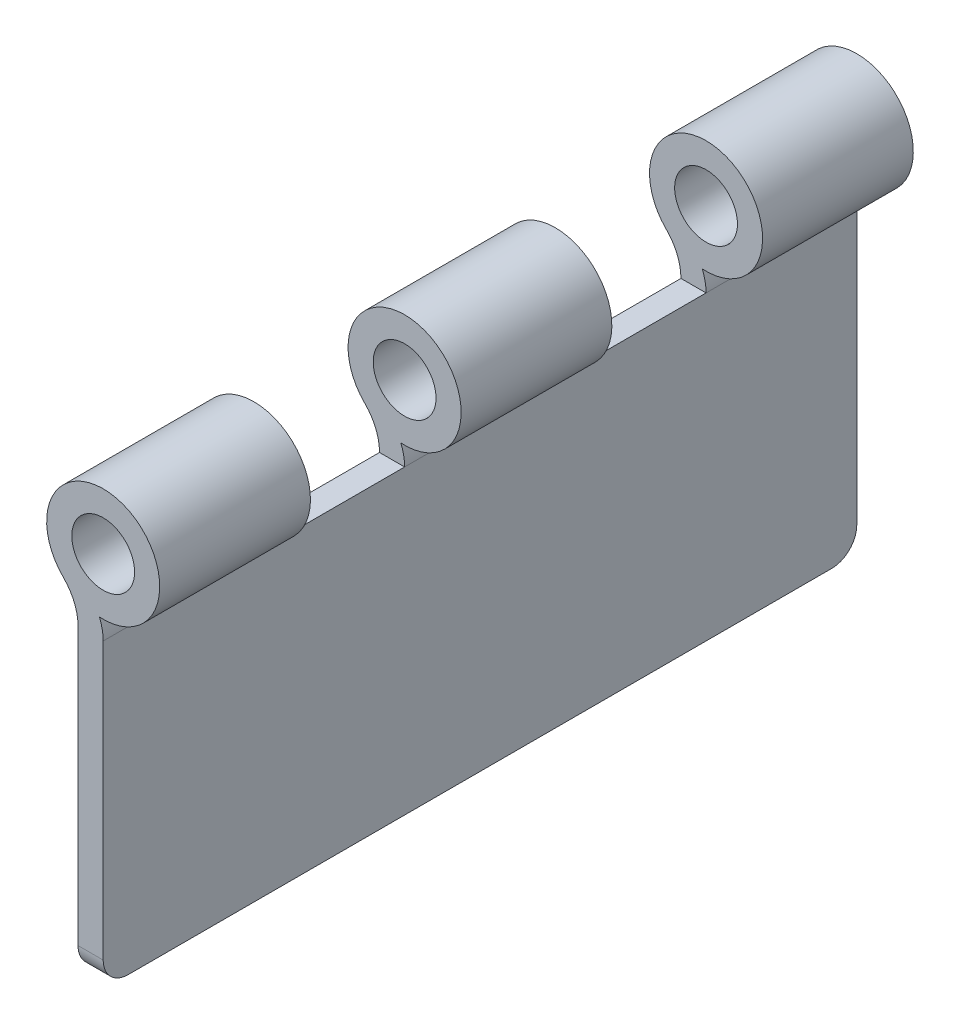
ISO-10303-21;
HEADER;
FILE_DESCRIPTION(('STEP AP214'),'2;1');
FILE_NAME('part.step','',(''),(''),'','','');
FILE_SCHEMA(('AUTOMOTIVE_DESIGN { 1 0 10303 214 1 1 1 1 }'));
ENDSEC;
DATA;
#1=APPLICATION_CONTEXT('core data for automotive mechanical design processes');
#2=APPLICATION_PROTOCOL_DEFINITION('international standard','automotive_design',2000,#1);
#3=PRODUCT_CONTEXT('',#1,'mechanical');
#4=PRODUCT('Part','Part','',(#3));
#5=PRODUCT_RELATED_PRODUCT_CATEGORY('part','',(#4));
#6=PRODUCT_DEFINITION_FORMATION('','',#4);
#7=PRODUCT_DEFINITION_CONTEXT('part definition',#1,'design');
#8=PRODUCT_DEFINITION('design','',#6,#7);
#9=PRODUCT_DEFINITION_SHAPE('','',#8);
#10=(LENGTH_UNIT() NAMED_UNIT(*) SI_UNIT(.MILLI.,.METRE.));
#11=(NAMED_UNIT(*) PLANE_ANGLE_UNIT() SI_UNIT($,.RADIAN.));
#12=(NAMED_UNIT(*) SI_UNIT($,.STERADIAN.) SOLID_ANGLE_UNIT());
#13=UNCERTAINTY_MEASURE_WITH_UNIT(LENGTH_MEASURE(1.E-05),#10,'distance_accuracy_value','');
#14=(GEOMETRIC_REPRESENTATION_CONTEXT(3) GLOBAL_UNCERTAINTY_ASSIGNED_CONTEXT((#13)) GLOBAL_UNIT_ASSIGNED_CONTEXT((#10,
#11,#12)) REPRESENTATION_CONTEXT('',''));
#15=CARTESIAN_POINT('',(0.,0.,0.));
#16=DIRECTION('',(0.,0.,1.));
#17=DIRECTION('',(1.,0.,0.));
#18=AXIS2_PLACEMENT_3D('',#15,#16,#17);
#19=CARTESIAN_POINT('',(-5.0165,30.48,38.1));
#20=DIRECTION('',(0.,0.,-1.));
#21=DIRECTION('',(-1.,0.,0.));
#22=AXIS2_PLACEMENT_3D('',#19,#20,#21);
#23=CYLINDRICAL_SURFACE('',#22,5.0165);
#24=CARTESIAN_POINT('',(-5.0165,30.48,-7.62));
#25=DIRECTION('',(0.,0.,1.));
#26=DIRECTION('',(1.,0.,0.));
#27=AXIS2_PLACEMENT_3D('',#24,#25,#26);
#28=CIRCLE('',#27,5.0165);
#29=CARTESIAN_POINT('',(0.,30.48,-7.62));
#30=VERTEX_POINT('',#29);
#31=CARTESIAN_POINT('',(-0.381023909004146,32.3977157400944,-7.62));
#32=VERTEX_POINT('',#31);
#33=EDGE_CURVE('E152',#30,#32,#28,.T.);
#34=ORIENTED_EDGE('',*,*,#33,.T.);
#35=DIRECTION('',(0.,0.,-1.));
#36=VECTOR('',#35,1.);
#37=CARTESIAN_POINT('',(-0.381023909004146,32.3977157400944,38.1));
#38=LINE('',#37,#36);
#39=CARTESIAN_POINT('',(-0.381023909004146,32.3977157400944,7.62));
#40=VERTEX_POINT('',#39);
#41=EDGE_CURVE('E247',#40,#32,#38,.T.);
#42=ORIENTED_EDGE('',*,*,#41,.F.);
#43=CARTESIAN_POINT('',(-5.0165,30.48,7.62));
#44=DIRECTION('',(0.,0.,1.));
#45=DIRECTION('',(1.,0.,0.));
#46=AXIS2_PLACEMENT_3D('',#43,#44,#45);
#47=CIRCLE('',#46,5.0165);
#48=CARTESIAN_POINT('',(0.,30.48,7.62));
#49=VERTEX_POINT('',#48);
#50=EDGE_CURVE('E184',#49,#40,#47,.T.);
#51=ORIENTED_EDGE('',*,*,#50,.F.);
#52=DIRECTION('',(0.,0.,-1.));
#53=VECTOR('',#52,1.);
#54=CARTESIAN_POINT('',(0.,30.48,38.1));
#55=LINE('',#54,#53);
#56=EDGE_CURVE('E179',#49,#30,#55,.T.);
#57=ORIENTED_EDGE('',*,*,#56,.T.);
#58=EDGE_LOOP('',(#34,#42,#51,#57));
#59=FACE_BOUND('',#58,.T.);
#60=ADVANCED_FACE('F38',(#59),#23,.T.);
#61=CARTESIAN_POINT('',(0.,38.1,38.1));
#62=DIRECTION('',(0.,0.,-1.));
#63=DIRECTION('',(-1.,0.,0.));
#64=AXIS2_PLACEMENT_3D('',#61,#62,#63);
#65=CYLINDRICAL_SURFACE('',#64,5.715);
#66=CARTESIAN_POINT('',(0.,38.1,-7.62));
#67=DIRECTION('',(0.,0.,1.));
#68=DIRECTION('',(1.,0.,0.));
#69=AXIS2_PLACEMENT_3D('',#66,#67,#68);
#70=CIRCLE('',#69,5.715);
#71=CARTESIAN_POINT('',(-4.02417159763314,34.0420118343195,-7.62));
#72=VERTEX_POINT('',#71);
#73=EDGE_CURVE('E158',#32,#72,#70,.T.);
#74=ORIENTED_EDGE('',*,*,#73,.T.);
#75=DIRECTION('',(0.,0.,-1.));
#76=VECTOR('',#75,1.);
#77=CARTESIAN_POINT('',(-4.02417159763314,34.0420118343195,38.1));
#78=LINE('',#77,#76);
#79=CARTESIAN_POINT('',(-4.02417159763314,34.0420118343195,7.62));
#80=VERTEX_POINT('',#79);
#81=EDGE_CURVE('E242',#80,#72,#78,.T.);
#82=ORIENTED_EDGE('',*,*,#81,.F.);
#83=CARTESIAN_POINT('',(0.,38.1,7.62));
#84=DIRECTION('',(0.,0.,1.));
#85=DIRECTION('',(1.,0.,0.));
#86=AXIS2_PLACEMENT_3D('',#83,#84,#85);
#87=CIRCLE('',#86,5.715);
#88=EDGE_CURVE('E311',#40,#80,#87,.T.);
#89=ORIENTED_EDGE('',*,*,#88,.F.);
#90=ORIENTED_EDGE('',*,*,#41,.T.);
#91=EDGE_LOOP('',(#74,#82,#89,#90));
#92=FACE_BOUND('',#91,.T.);
#93=ADVANCED_FACE('F355',(#92),#65,.T.);
#94=CARTESIAN_POINT('',(-7.55650000000001,30.48,38.1));
#95=DIRECTION('',(0.,0.,-1.));
#96=DIRECTION('',(-1.,0.,0.));
#97=AXIS2_PLACEMENT_3D('',#94,#95,#96);
#98=CYLINDRICAL_SURFACE('',#97,5.01650000000001);
#99=ORIENTED_EDGE('',*,*,#81,.T.);
#100=CARTESIAN_POINT('',(-7.55650000000001,30.48,-7.62));
#101=DIRECTION('',(0.,0.,1.));
#102=DIRECTION('',(1.,0.,0.));
#103=AXIS2_PLACEMENT_3D('',#100,#101,#102);
#104=CIRCLE('',#103,5.01650000000001);
#105=CARTESIAN_POINT('',(-2.54,30.48,-7.62));
#106=VERTEX_POINT('',#105);
#107=EDGE_CURVE('E172',#106,#72,#104,.T.);
#108=ORIENTED_EDGE('',*,*,#107,.F.);
#109=DIRECTION('',(0.,0.,-1.));
#110=VECTOR('',#109,1.);
#111=CARTESIAN_POINT('',(-2.54,30.48,38.1));
#112=LINE('',#111,#110);
#113=CARTESIAN_POINT('',(-2.54,30.48,7.62000000000001));
#114=VERTEX_POINT('',#113);
#115=EDGE_CURVE('E231',#114,#106,#112,.T.);
#116=ORIENTED_EDGE('',*,*,#115,.F.);
#117=CARTESIAN_POINT('',(-7.55650000000001,30.48,7.62));
#118=DIRECTION('',(0.,0.,1.));
#119=DIRECTION('',(1.,0.,0.));
#120=AXIS2_PLACEMENT_3D('',#117,#118,#119);
#121=CIRCLE('',#120,5.01650000000001);
#122=EDGE_CURVE('E313',#114,#80,#121,.T.);
#123=ORIENTED_EDGE('',*,*,#122,.T.);
#124=EDGE_LOOP('',(#99,#108,#116,#123));
#125=FACE_BOUND('',#124,.T.);
#126=ADVANCED_FACE('F361',(#125),#98,.F.);
#127=CARTESIAN_POINT('',(0.,38.1,38.1));
#128=DIRECTION('',(0.,0.,-1.));
#129=DIRECTION('',(-1.,0.,0.));
#130=AXIS2_PLACEMENT_3D('',#127,#128,#129);
#131=CYLINDRICAL_SURFACE('',#130,3.175);
#132=CARTESIAN_POINT('',(0.,38.1,7.62));
#133=DIRECTION('',(0.,0.,1.));
#134=DIRECTION('',(1.,0.,0.));
#135=AXIS2_PLACEMENT_3D('',#132,#133,#134);
#136=CIRCLE('',#135,3.175);
#137=CARTESIAN_POINT('',(3.175,38.1,7.62));
#138=VERTEX_POINT('',#137);
#139=EDGE_CURVE('E306',#138,#138,#136,.T.);
#140=ORIENTED_EDGE('',*,*,#139,.T.);
#141=EDGE_LOOP('',(#140));
#142=FACE_BOUND('',#141,.T.);
#143=CARTESIAN_POINT('',(0.,38.1,-7.62));
#144=DIRECTION('',(0.,0.,1.));
#145=DIRECTION('',(1.,0.,0.));
#146=AXIS2_PLACEMENT_3D('',#143,#144,#145);
#147=CIRCLE('',#146,3.175);
#148=CARTESIAN_POINT('',(3.175,38.1,-7.62));
#149=VERTEX_POINT('',#148);
#150=EDGE_CURVE('E163',#149,#149,#147,.T.);
#151=ORIENTED_EDGE('',*,*,#150,.F.);
#152=EDGE_LOOP('',(#151));
#153=FACE_BOUND('',#152,.T.);
#154=ADVANCED_FACE('F368',(#142,#153),#131,.F.);
#155=CARTESIAN_POINT('',(-0.381023909004146,32.3977157400944,-22.86));
#156=VERTEX_POINT('',#155);
#157=CARTESIAN_POINT('',(-0.381023909004146,32.3977157400944,-38.1));
#158=VERTEX_POINT('',#157);
#159=EDGE_CURVE('E241',#156,#158,#38,.T.);
#160=ORIENTED_EDGE('',*,*,#159,.F.);
#161=CARTESIAN_POINT('',(-5.0165,30.48,-22.86));
#162=DIRECTION('',(0.,0.,1.));
#163=DIRECTION('',(1.,0.,0.));
#164=AXIS2_PLACEMENT_3D('',#161,#162,#163);
#165=CIRCLE('',#164,5.0165);
#166=CARTESIAN_POINT('',(0.,30.48,-22.86));
#167=VERTEX_POINT('',#166);
#168=EDGE_CURVE('E291',#167,#156,#165,.T.);
#169=ORIENTED_EDGE('',*,*,#168,.F.);
#170=CARTESIAN_POINT('',(0.,30.48,-38.1));
#171=VERTEX_POINT('',#170);
#172=EDGE_CURVE('E181',#167,#171,#55,.T.);
#173=ORIENTED_EDGE('',*,*,#172,.T.);
#174=CARTESIAN_POINT('',(-5.0165,30.48,-38.1));
#175=DIRECTION('',(0.,0.,1.));
#176=DIRECTION('',(1.,0.,0.));
#177=AXIS2_PLACEMENT_3D('',#174,#175,#176);
#178=CIRCLE('',#177,5.0165);
#179=EDGE_CURVE('E217',#171,#158,#178,.T.);
#180=ORIENTED_EDGE('',*,*,#179,.T.);
#181=EDGE_LOOP('',(#160,#169,#173,#180));
#182=FACE_BOUND('',#181,.T.);
#183=ADVANCED_FACE('F289',(#182),#23,.T.);
#184=CARTESIAN_POINT('',(-4.02417159763314,34.0420118343195,-22.86));
#185=VERTEX_POINT('',#184);
#186=CARTESIAN_POINT('',(-4.02417159763314,34.0420118343195,-38.1));
#187=VERTEX_POINT('',#186);
#188=EDGE_CURVE('E238',#185,#187,#78,.T.);
#189=ORIENTED_EDGE('',*,*,#188,.F.);
#190=CARTESIAN_POINT('',(0.,38.1,-22.86));
#191=DIRECTION('',(0.,0.,1.));
#192=DIRECTION('',(1.,0.,0.));
#193=AXIS2_PLACEMENT_3D('',#190,#191,#192);
#194=CIRCLE('',#193,5.715);
#195=EDGE_CURVE('E302',#156,#185,#194,.T.);
#196=ORIENTED_EDGE('',*,*,#195,.F.);
#197=ORIENTED_EDGE('',*,*,#159,.T.);
#198=CARTESIAN_POINT('',(0.,38.1,-38.1));
#199=DIRECTION('',(0.,0.,1.));
#200=DIRECTION('',(1.,0.,0.));
#201=AXIS2_PLACEMENT_3D('',#198,#199,#200);
#202=CIRCLE('',#201,5.715);
#203=EDGE_CURVE('E262',#158,#187,#202,.T.);
#204=ORIENTED_EDGE('',*,*,#203,.T.);
#205=EDGE_LOOP('',(#189,#196,#197,#204));
#206=FACE_BOUND('',#205,.T.);
#207=ADVANCED_FACE('F263',(#206),#65,.T.);
#208=CARTESIAN_POINT('',(-7.55650000000001,30.48,-22.86));
#209=DIRECTION('',(0.,0.,1.));
#210=DIRECTION('',(1.,0.,0.));
#211=AXIS2_PLACEMENT_3D('',#208,#209,#210);
#212=CIRCLE('',#211,5.01650000000001);
#213=CARTESIAN_POINT('',(-2.54,30.48,-22.86));
#214=VERTEX_POINT('',#213);
#215=EDGE_CURVE('E259',#214,#185,#212,.T.);
#216=ORIENTED_EDGE('',*,*,#215,.T.);
#217=ORIENTED_EDGE('',*,*,#188,.T.);
#218=CARTESIAN_POINT('',(-7.55650000000001,30.48,-38.1));
#219=DIRECTION('',(0.,0.,1.));
#220=DIRECTION('',(1.,0.,0.));
#221=AXIS2_PLACEMENT_3D('',#218,#219,#220);
#222=CIRCLE('',#221,5.01650000000001);
#223=CARTESIAN_POINT('',(-2.54,30.48,-38.1));
#224=VERTEX_POINT('',#223);
#225=EDGE_CURVE('E257',#224,#187,#222,.T.);
#226=ORIENTED_EDGE('',*,*,#225,.F.);
#227=EDGE_CURVE('E229',#214,#224,#112,.T.);
#228=ORIENTED_EDGE('',*,*,#227,.F.);
#229=EDGE_LOOP('',(#216,#217,#226,#228));
#230=FACE_BOUND('',#229,.T.);
#231=ADVANCED_FACE('F254',(#230),#98,.F.);
#232=CARTESIAN_POINT('',(0.,38.1,-22.86));
#233=DIRECTION('',(0.,0.,1.));
#234=DIRECTION('',(1.,0.,0.));
#235=AXIS2_PLACEMENT_3D('',#232,#233,#234);
#236=CIRCLE('',#235,3.175);
#237=CARTESIAN_POINT('',(3.175,38.1,-22.86));
#238=VERTEX_POINT('',#237);
#239=EDGE_CURVE('E294',#238,#238,#236,.T.);
#240=ORIENTED_EDGE('',*,*,#239,.T.);
#241=EDGE_LOOP('',(#240));
#242=FACE_BOUND('',#241,.T.);
#243=CARTESIAN_POINT('',(0.,38.1,-38.1));
#244=DIRECTION('',(0.,0.,1.));
#245=DIRECTION('',(1.,0.,0.));
#246=AXIS2_PLACEMENT_3D('',#243,#244,#245);
#247=CIRCLE('',#246,3.175);
#248=CARTESIAN_POINT('',(3.175,38.1,-38.1));
#249=VERTEX_POINT('',#248);
#250=EDGE_CURVE('E267',#249,#249,#247,.T.);
#251=ORIENTED_EDGE('',*,*,#250,.F.);
#252=EDGE_LOOP('',(#251));
#253=FACE_BOUND('',#252,.T.);
#254=ADVANCED_FACE('F372',(#242,#253),#131,.F.);
#255=CARTESIAN_POINT('',(0.,0.,38.1));
#256=DIRECTION('',(-1.,0.,0.));
#257=DIRECTION('',(0.,0.,1.));
#258=AXIS2_PLACEMENT_3D('',#255,#256,#257);
#259=PLANE('',#258);
#260=DIRECTION('',(0.,0.,-1.));
#261=VECTOR('',#260,1.);
#262=CARTESIAN_POINT('',(0.,0.,38.1));
#263=LINE('',#262,#261);
#264=CARTESIAN_POINT('',(0.,0.,35.56));
#265=VERTEX_POINT('',#264);
#266=CARTESIAN_POINT('',(0.,0.,-35.56));
#267=VERTEX_POINT('',#266);
#268=EDGE_CURVE('E207',#265,#267,#263,.T.);
#269=ORIENTED_EDGE('',*,*,#268,.T.);
#270=CARTESIAN_POINT('',(0.,2.54,-35.56));
#271=DIRECTION('',(-1.,0.,0.));
#272=DIRECTION('',(0.,0.,1.));
#273=AXIS2_PLACEMENT_3D('',#270,#271,#272);
#274=CIRCLE('',#273,2.54);
#275=CARTESIAN_POINT('',(0.,2.54,-38.1));
#276=VERTEX_POINT('',#275);
#277=EDGE_CURVE('E46',#267,#276,#274,.F.);
#278=ORIENTED_EDGE('',*,*,#277,.T.);
#279=DIRECTION('',(0.,1.,0.));
#280=VECTOR('',#279,1.);
#281=CARTESIAN_POINT('',(0.,0.,-38.1));
#282=LINE('',#281,#280);
#283=EDGE_CURVE('E206',#276,#171,#282,.T.);
#284=ORIENTED_EDGE('',*,*,#283,.T.);
#285=ORIENTED_EDGE('',*,*,#172,.F.);
#286=DIRECTION('',(0.,0.,-1.));
#287=VECTOR('',#286,1.);
#288=CARTESIAN_POINT('',(0.,30.48,-7.62));
#289=LINE('',#288,#287);
#290=EDGE_CURVE('E168',#30,#167,#289,.T.);
#291=ORIENTED_EDGE('',*,*,#290,.F.);
#292=ORIENTED_EDGE('',*,*,#56,.F.);
#293=DIRECTION('',(0.,0.,1.));
#294=VECTOR('',#293,1.);
#295=CARTESIAN_POINT('',(0.,30.48,7.62));
#296=LINE('',#295,#294);
#297=CARTESIAN_POINT('',(0.,30.48,22.86));
#298=VERTEX_POINT('',#297);
#299=EDGE_CURVE('E218',#49,#298,#296,.T.);
#300=ORIENTED_EDGE('',*,*,#299,.T.);
#301=CARTESIAN_POINT('',(0.,30.48,38.1));
#302=VERTEX_POINT('',#301);
#303=EDGE_CURVE('E185',#302,#298,#55,.T.);
#304=ORIENTED_EDGE('',*,*,#303,.F.);
#305=DIRECTION('',(0.,1.,0.));
#306=VECTOR('',#305,1.);
#307=CARTESIAN_POINT('',(0.,0.,38.1));
#308=LINE('',#307,#306);
#309=CARTESIAN_POINT('',(0.,2.54,38.1));
#310=VERTEX_POINT('',#309);
#311=EDGE_CURVE('E271',#310,#302,#308,.T.);
#312=ORIENTED_EDGE('',*,*,#311,.F.);
#313=CARTESIAN_POINT('',(0.,2.54,35.56));
#314=DIRECTION('',(-1.,0.,0.));
#315=DIRECTION('',(0.,0.,1.));
#316=AXIS2_PLACEMENT_3D('',#313,#314,#315);
#317=CIRCLE('',#316,2.54);
#318=EDGE_CURVE('E203',#310,#265,#317,.F.);
#319=ORIENTED_EDGE('',*,*,#318,.T.);
#320=EDGE_LOOP('',(#269,#278,#284,#285,#291,#292,#300,#304,#312,#319));
#321=FACE_BOUND('',#320,.T.);
#322=ADVANCED_FACE('F177',(#321),#259,.F.);
#323=ORIENTED_EDGE('',*,*,#303,.T.);
#324=CARTESIAN_POINT('',(-5.0165,30.48,22.86));
#325=DIRECTION('',(0.,0.,1.));
#326=DIRECTION('',(1.,0.,0.));
#327=AXIS2_PLACEMENT_3D('',#324,#325,#326);
#328=CIRCLE('',#327,5.0165);
#329=CARTESIAN_POINT('',(-0.381023909004146,32.3977157400944,22.86));
#330=VERTEX_POINT('',#329);
#331=EDGE_CURVE('E320',#298,#330,#328,.T.);
#332=ORIENTED_EDGE('',*,*,#331,.T.);
#333=CARTESIAN_POINT('',(-0.381023909004146,32.3977157400944,38.1));
#334=VERTEX_POINT('',#333);
#335=EDGE_CURVE('E189',#334,#330,#38,.T.);
#336=ORIENTED_EDGE('',*,*,#335,.F.);
#337=CARTESIAN_POINT('',(-5.0165,30.48,38.1));
#338=DIRECTION('',(0.,0.,1.));
#339=DIRECTION('',(1.,0.,0.));
#340=AXIS2_PLACEMENT_3D('',#337,#338,#339);
#341=CIRCLE('',#340,5.0165);
#342=EDGE_CURVE('E273',#302,#334,#341,.T.);
#343=ORIENTED_EDGE('',*,*,#342,.F.);
#344=EDGE_LOOP('',(#323,#332,#336,#343));
#345=FACE_BOUND('',#344,.T.);
#346=ADVANCED_FACE('F347',(#345),#23,.T.);
#347=ORIENTED_EDGE('',*,*,#335,.T.);
#348=CARTESIAN_POINT('',(0.,38.1,22.86));
#349=DIRECTION('',(0.,0.,1.));
#350=DIRECTION('',(1.,0.,0.));
#351=AXIS2_PLACEMENT_3D('',#348,#349,#350);
#352=CIRCLE('',#351,5.715);
#353=CARTESIAN_POINT('',(-4.02417159763314,34.0420118343195,22.86));
#354=VERTEX_POINT('',#353);
#355=EDGE_CURVE('E323',#330,#354,#352,.T.);
#356=ORIENTED_EDGE('',*,*,#355,.T.);
#357=CARTESIAN_POINT('',(-4.02417159763314,34.0420118343195,38.1));
#358=VERTEX_POINT('',#357);
#359=EDGE_CURVE('E239',#358,#354,#78,.T.);
#360=ORIENTED_EDGE('',*,*,#359,.F.);
#361=CARTESIAN_POINT('',(0.,38.1,38.1));
#362=DIRECTION('',(0.,0.,1.));
#363=DIRECTION('',(1.,0.,0.));
#364=AXIS2_PLACEMENT_3D('',#361,#362,#363);
#365=CIRCLE('',#364,5.715);
#366=EDGE_CURVE('E276',#334,#358,#365,.T.);
#367=ORIENTED_EDGE('',*,*,#366,.F.);
#368=EDGE_LOOP('',(#347,#356,#360,#367));
#369=FACE_BOUND('',#368,.T.);
#370=ADVANCED_FACE('F352',(#369),#65,.T.);
#371=CARTESIAN_POINT('',(-7.55650000000001,30.48,22.86));
#372=DIRECTION('',(0.,0.,1.));
#373=DIRECTION('',(1.,0.,0.));
#374=AXIS2_PLACEMENT_3D('',#371,#372,#373);
#375=CIRCLE('',#374,5.01650000000001);
#376=CARTESIAN_POINT('',(-2.54,30.48,22.86));
#377=VERTEX_POINT('',#376);
#378=EDGE_CURVE('E326',#377,#354,#375,.T.);
#379=ORIENTED_EDGE('',*,*,#378,.F.);
#380=CARTESIAN_POINT('',(-2.54,30.48,38.1));
#381=VERTEX_POINT('',#380);
#382=EDGE_CURVE('E233',#381,#377,#112,.T.);
#383=ORIENTED_EDGE('',*,*,#382,.F.);
#384=CARTESIAN_POINT('',(-7.55650000000001,30.48,38.1));
#385=DIRECTION('',(0.,0.,1.));
#386=DIRECTION('',(1.,0.,0.));
#387=AXIS2_PLACEMENT_3D('',#384,#385,#386);
#388=CIRCLE('',#387,5.01650000000001);
#389=EDGE_CURVE('E283',#381,#358,#388,.T.);
#390=ORIENTED_EDGE('',*,*,#389,.T.);
#391=ORIENTED_EDGE('',*,*,#359,.T.);
#392=EDGE_LOOP('',(#379,#383,#390,#391));
#393=FACE_BOUND('',#392,.T.);
#394=ADVANCED_FACE('F340',(#393),#98,.F.);
#395=CARTESIAN_POINT('',(-2.54,0.,38.1));
#396=DIRECTION('',(-1.,0.,0.));
#397=DIRECTION('',(0.,0.,1.));
#398=AXIS2_PLACEMENT_3D('',#395,#396,#397);
#399=PLANE('',#398);
#400=DIRECTION('',(0.,1.,0.));
#401=VECTOR('',#400,1.);
#402=CARTESIAN_POINT('',(-2.54,0.,-38.1));
#403=LINE('',#402,#401);
#404=CARTESIAN_POINT('',(-2.54,2.54,-38.1));
#405=VERTEX_POINT('',#404);
#406=EDGE_CURVE('E226',#405,#224,#403,.T.);
#407=ORIENTED_EDGE('',*,*,#406,.F.);
#408=CARTESIAN_POINT('',(-2.54,2.54,-35.56));
#409=DIRECTION('',(-1.,0.,0.));
#410=DIRECTION('',(0.,0.,1.));
#411=AXIS2_PLACEMENT_3D('',#408,#409,#410);
#412=CIRCLE('',#411,2.54);
#413=CARTESIAN_POINT('',(-2.54,0.,-35.56));
#414=VERTEX_POINT('',#413);
#415=EDGE_CURVE('E197',#405,#414,#412,.T.);
#416=ORIENTED_EDGE('',*,*,#415,.T.);
#417=DIRECTION('',(0.,0.,-1.));
#418=VECTOR('',#417,1.);
#419=CARTESIAN_POINT('',(-2.54,0.,38.1));
#420=LINE('',#419,#418);
#421=CARTESIAN_POINT('',(-2.54,0.,35.56));
#422=VERTEX_POINT('',#421);
#423=EDGE_CURVE('E224',#422,#414,#420,.T.);
#424=ORIENTED_EDGE('',*,*,#423,.F.);
#425=CARTESIAN_POINT('',(-2.54,2.54,35.56));
#426=DIRECTION('',(-1.,0.,0.));
#427=DIRECTION('',(0.,0.,1.));
#428=AXIS2_PLACEMENT_3D('',#425,#426,#427);
#429=CIRCLE('',#428,2.54);
#430=CARTESIAN_POINT('',(-2.54,2.54,38.1));
#431=VERTEX_POINT('',#430);
#432=EDGE_CURVE('E195',#422,#431,#429,.T.);
#433=ORIENTED_EDGE('',*,*,#432,.T.);
#434=DIRECTION('',(0.,1.,0.));
#435=VECTOR('',#434,1.);
#436=CARTESIAN_POINT('',(-2.54,0.,38.1));
#437=LINE('',#436,#435);
#438=EDGE_CURVE('E285',#431,#381,#437,.T.);
#439=ORIENTED_EDGE('',*,*,#438,.T.);
#440=ORIENTED_EDGE('',*,*,#382,.T.);
#441=DIRECTION('',(0.,0.,1.));
#442=VECTOR('',#441,1.);
#443=CARTESIAN_POINT('',(-2.54,30.48,7.62));
#444=LINE('',#443,#442);
#445=EDGE_CURVE('E279',#114,#377,#444,.T.);
#446=ORIENTED_EDGE('',*,*,#445,.F.);
#447=ORIENTED_EDGE('',*,*,#115,.T.);
#448=DIRECTION('',(0.,0.,-1.));
#449=VECTOR('',#448,1.);
#450=CARTESIAN_POINT('',(-2.54,30.48,-7.62));
#451=LINE('',#450,#449);
#452=EDGE_CURVE('E171',#106,#214,#451,.T.);
#453=ORIENTED_EDGE('',*,*,#452,.T.);
#454=ORIENTED_EDGE('',*,*,#227,.T.);
#455=EDGE_LOOP('',(#407,#416,#424,#433,#439,#440,#446,#447,#453,#454));
#456=FACE_BOUND('',#455,.T.);
#457=ADVANCED_FACE('F223',(#456),#399,.T.);
#458=CARTESIAN_POINT('',(0.,0.,38.1));
#459=DIRECTION('',(0.,-1.,0.));
#460=DIRECTION('',(1.,0.,0.));
#461=AXIS2_PLACEMENT_3D('',#458,#459,#460);
#462=PLANE('',#461);
#463=ORIENTED_EDGE('',*,*,#423,.T.);
#464=DIRECTION('',(-1.,0.,0.));
#465=VECTOR('',#464,1.);
#466=CARTESIAN_POINT('',(0.,0.,-35.56));
#467=LINE('',#466,#465);
#468=EDGE_CURVE('E59',#414,#267,#467,.F.);
#469=ORIENTED_EDGE('',*,*,#468,.T.);
#470=ORIENTED_EDGE('',*,*,#268,.F.);
#471=DIRECTION('',(-1.,0.,0.));
#472=VECTOR('',#471,1.);
#473=CARTESIAN_POINT('',(0.,0.,35.56));
#474=LINE('',#473,#472);
#475=EDGE_CURVE('E199',#265,#422,#474,.T.);
#476=ORIENTED_EDGE('',*,*,#475,.T.);
#477=EDGE_LOOP('',(#463,#469,#470,#476));
#478=FACE_BOUND('',#477,.T.);
#479=ADVANCED_FACE('F227',(#478),#462,.T.);
#480=CARTESIAN_POINT('',(0.,38.1,22.86));
#481=DIRECTION('',(0.,0.,1.));
#482=DIRECTION('',(1.,0.,0.));
#483=AXIS2_PLACEMENT_3D('',#480,#481,#482);
#484=CIRCLE('',#483,3.175);
#485=CARTESIAN_POINT('',(3.175,38.1,22.86));
#486=VERTEX_POINT('',#485);
#487=EDGE_CURVE('E304',#486,#486,#484,.T.);
#488=ORIENTED_EDGE('',*,*,#487,.F.);
#489=EDGE_LOOP('',(#488));
#490=FACE_BOUND('',#489,.T.);
#491=CARTESIAN_POINT('',(0.,38.1,38.1));
#492=DIRECTION('',(0.,0.,1.));
#493=DIRECTION('',(1.,0.,0.));
#494=AXIS2_PLACEMENT_3D('',#491,#492,#493);
#495=CIRCLE('',#494,3.175);
#496=CARTESIAN_POINT('',(3.175,38.1,38.1));
#497=VERTEX_POINT('',#496);
#498=EDGE_CURVE('E234',#497,#497,#495,.T.);
#499=ORIENTED_EDGE('',*,*,#498,.T.);
#500=EDGE_LOOP('',(#499));
#501=FACE_BOUND('',#500,.T.);
#502=ADVANCED_FACE('F373',(#490,#501),#131,.F.);
#503=CARTESIAN_POINT('',(0.,0.,38.1));
#504=DIRECTION('',(0.,0.,1.));
#505=DIRECTION('',(1.,0.,0.));
#506=AXIS2_PLACEMENT_3D('',#503,#504,#505);
#507=PLANE('',#506);
#508=ORIENTED_EDGE('',*,*,#438,.F.);
#509=DIRECTION('',(-1.,0.,0.));
#510=VECTOR('',#509,1.);
#511=CARTESIAN_POINT('',(0.,2.54,38.1));
#512=LINE('',#511,#510);
#513=EDGE_CURVE('E11',#431,#310,#512,.F.);
#514=ORIENTED_EDGE('',*,*,#513,.T.);
#515=ORIENTED_EDGE('',*,*,#311,.T.);
#516=ORIENTED_EDGE('',*,*,#342,.T.);
#517=ORIENTED_EDGE('',*,*,#366,.T.);
#518=ORIENTED_EDGE('',*,*,#389,.F.);
#519=EDGE_LOOP('',(#508,#514,#515,#516,#517,#518));
#520=FACE_BOUND('',#519,.T.);
#521=ORIENTED_EDGE('',*,*,#498,.F.);
#522=EDGE_LOOP('',(#521));
#523=FACE_BOUND('',#522,.T.);
#524=ADVANCED_FACE('F342',(#520,#523),#507,.T.);
#525=CARTESIAN_POINT('',(0.,0.,-38.1));
#526=DIRECTION('',(0.,0.,1.));
#527=DIRECTION('',(1.,0.,0.));
#528=AXIS2_PLACEMENT_3D('',#525,#526,#527);
#529=PLANE('',#528);
#530=ORIENTED_EDGE('',*,*,#283,.F.);
#531=DIRECTION('',(-1.,0.,0.));
#532=VECTOR('',#531,1.);
#533=CARTESIAN_POINT('',(-2.54,2.54,-38.1));
#534=LINE('',#533,#532);
#535=EDGE_CURVE('E188',#276,#405,#534,.T.);
#536=ORIENTED_EDGE('',*,*,#535,.T.);
#537=ORIENTED_EDGE('',*,*,#406,.T.);
#538=ORIENTED_EDGE('',*,*,#225,.T.);
#539=ORIENTED_EDGE('',*,*,#203,.F.);
#540=ORIENTED_EDGE('',*,*,#179,.F.);
#541=EDGE_LOOP('',(#530,#536,#537,#538,#539,#540));
#542=FACE_BOUND('',#541,.T.);
#543=ORIENTED_EDGE('',*,*,#250,.T.);
#544=EDGE_LOOP('',(#543));
#545=FACE_BOUND('',#544,.T.);
#546=ADVANCED_FACE('F212',(#542,#545),#529,.F.);
#547=CARTESIAN_POINT('',(0.,30.48,7.62));
#548=DIRECTION('',(0.,1.,0.));
#549=DIRECTION('',(-1.,0.,0.));
#550=AXIS2_PLACEMENT_3D('',#547,#548,#549);
#551=PLANE('',#550);
#552=DIRECTION('',(-1.,0.,0.));
#553=VECTOR('',#552,1.);
#554=CARTESIAN_POINT('',(0.,30.48,22.86));
#555=LINE('',#554,#553);
#556=EDGE_CURVE('E309',#298,#377,#555,.T.);
#557=ORIENTED_EDGE('',*,*,#556,.F.);
#558=ORIENTED_EDGE('',*,*,#299,.F.);
#559=DIRECTION('',(-1.,0.,0.));
#560=VECTOR('',#559,1.);
#561=CARTESIAN_POINT('',(0.,30.48,7.62));
#562=LINE('',#561,#560);
#563=EDGE_CURVE('E316',#49,#114,#562,.T.);
#564=ORIENTED_EDGE('',*,*,#563,.T.);
#565=ORIENTED_EDGE('',*,*,#445,.T.);
#566=EDGE_LOOP('',(#557,#558,#564,#565));
#567=FACE_BOUND('',#566,.T.);
#568=ADVANCED_FACE('F332',(#567),#551,.T.);
#569=CARTESIAN_POINT('',(0.,0.,7.62));
#570=DIRECTION('',(0.,0.,1.));
#571=DIRECTION('',(1.,0.,0.));
#572=AXIS2_PLACEMENT_3D('',#569,#570,#571);
#573=PLANE('',#572);
#574=ORIENTED_EDGE('',*,*,#139,.F.);
#575=EDGE_LOOP('',(#574));
#576=FACE_BOUND('',#575,.T.);
#577=ORIENTED_EDGE('',*,*,#50,.T.);
#578=ORIENTED_EDGE('',*,*,#88,.T.);
#579=ORIENTED_EDGE('',*,*,#122,.F.);
#580=ORIENTED_EDGE('',*,*,#563,.F.);
#581=EDGE_LOOP('',(#577,#578,#579,#580));
#582=FACE_BOUND('',#581,.T.);
#583=ADVANCED_FACE('F358',(#576,#582),#573,.T.);
#584=CARTESIAN_POINT('',(0.,0.,22.86));
#585=DIRECTION('',(0.,0.,1.));
#586=DIRECTION('',(1.,0.,0.));
#587=AXIS2_PLACEMENT_3D('',#584,#585,#586);
#588=PLANE('',#587);
#589=ORIENTED_EDGE('',*,*,#487,.T.);
#590=EDGE_LOOP('',(#589));
#591=FACE_BOUND('',#590,.T.);
#592=ORIENTED_EDGE('',*,*,#331,.F.);
#593=ORIENTED_EDGE('',*,*,#556,.T.);
#594=ORIENTED_EDGE('',*,*,#378,.T.);
#595=ORIENTED_EDGE('',*,*,#355,.F.);
#596=EDGE_LOOP('',(#592,#593,#594,#595));
#597=FACE_BOUND('',#596,.T.);
#598=ADVANCED_FACE('F338',(#591,#597),#588,.F.);
#599=CARTESIAN_POINT('',(0.,30.48,-7.62));
#600=DIRECTION('',(0.,-1.,0.));
#601=DIRECTION('',(1.,0.,0.));
#602=AXIS2_PLACEMENT_3D('',#599,#600,#601);
#603=PLANE('',#602);
#604=DIRECTION('',(-1.,0.,0.));
#605=VECTOR('',#604,1.);
#606=CARTESIAN_POINT('',(0.,30.48,-22.86));
#607=LINE('',#606,#605);
#608=EDGE_CURVE('E293',#167,#214,#607,.T.);
#609=ORIENTED_EDGE('',*,*,#608,.T.);
#610=ORIENTED_EDGE('',*,*,#452,.F.);
#611=DIRECTION('',(-1.,0.,0.));
#612=VECTOR('',#611,1.);
#613=CARTESIAN_POINT('',(0.,30.48,-7.62));
#614=LINE('',#613,#612);
#615=EDGE_CURVE('E155',#30,#106,#614,.T.);
#616=ORIENTED_EDGE('',*,*,#615,.F.);
#617=ORIENTED_EDGE('',*,*,#290,.T.);
#618=EDGE_LOOP('',(#609,#610,#616,#617));
#619=FACE_BOUND('',#618,.T.);
#620=ADVANCED_FACE('F167',(#619),#603,.F.);
#621=CARTESIAN_POINT('',(0.,0.,-7.62));
#622=DIRECTION('',(0.,0.,-1.));
#623=DIRECTION('',(1.,0.,0.));
#624=AXIS2_PLACEMENT_3D('',#621,#622,#623);
#625=PLANE('',#624);
#626=ORIENTED_EDGE('',*,*,#150,.T.);
#627=EDGE_LOOP('',(#626));
#628=FACE_BOUND('',#627,.T.);
#629=ORIENTED_EDGE('',*,*,#33,.F.);
#630=ORIENTED_EDGE('',*,*,#615,.T.);
#631=ORIENTED_EDGE('',*,*,#107,.T.);
#632=ORIENTED_EDGE('',*,*,#73,.F.);
#633=EDGE_LOOP('',(#629,#630,#631,#632));
#634=FACE_BOUND('',#633,.T.);
#635=ADVANCED_FACE('F154',(#628,#634),#625,.T.);
#636=CARTESIAN_POINT('',(0.,0.,-22.86));
#637=DIRECTION('',(0.,0.,-1.));
#638=DIRECTION('',(1.,0.,0.));
#639=AXIS2_PLACEMENT_3D('',#636,#637,#638);
#640=PLANE('',#639);
#641=ORIENTED_EDGE('',*,*,#239,.F.);
#642=EDGE_LOOP('',(#641));
#643=FACE_BOUND('',#642,.T.);
#644=ORIENTED_EDGE('',*,*,#168,.T.);
#645=ORIENTED_EDGE('',*,*,#195,.T.);
#646=ORIENTED_EDGE('',*,*,#215,.F.);
#647=ORIENTED_EDGE('',*,*,#608,.F.);
#648=EDGE_LOOP('',(#644,#645,#646,#647));
#649=FACE_BOUND('',#648,.T.);
#650=ADVANCED_FACE('F400',(#643,#649),#640,.F.);
#651=CARTESIAN_POINT('',(0.,2.54,-35.56));
#652=DIRECTION('',(1.,0.,0.));
#653=DIRECTION('',(0.,1.,0.));
#654=AXIS2_PLACEMENT_3D('',#651,#652,#653);
#655=CYLINDRICAL_SURFACE('',#654,2.54);
#656=ORIENTED_EDGE('',*,*,#277,.F.);
#657=ORIENTED_EDGE('',*,*,#468,.F.);
#658=ORIENTED_EDGE('',*,*,#415,.F.);
#659=ORIENTED_EDGE('',*,*,#535,.F.);
#660=EDGE_LOOP('',(#656,#657,#658,#659));
#661=FACE_BOUND('',#660,.T.);
#662=ADVANCED_FACE('F220',(#661),#655,.T.);
#663=CARTESIAN_POINT('',(0.,2.54,35.56));
#664=DIRECTION('',(-1.,0.,0.));
#665=DIRECTION('',(0.,-1.,0.));
#666=AXIS2_PLACEMENT_3D('',#663,#664,#665);
#667=CYLINDRICAL_SURFACE('',#666,2.54);
#668=ORIENTED_EDGE('',*,*,#318,.F.);
#669=ORIENTED_EDGE('',*,*,#513,.F.);
#670=ORIENTED_EDGE('',*,*,#432,.F.);
#671=ORIENTED_EDGE('',*,*,#475,.F.);
#672=EDGE_LOOP('',(#668,#669,#670,#671));
#673=FACE_BOUND('',#672,.T.);
#674=ADVANCED_FACE('F40',(#673),#667,.T.);
#675=CLOSED_SHELL('',(#60,#93,#126,#154,#183,#207,#231,#254,#322,#346,#370,#394,#457,#479,#502,
#524,#546,#568,#583,#598,#620,#635,#650,#662,#674));
#676=MANIFOLD_SOLID_BREP('B2',#675);
#677=ADVANCED_BREP_SHAPE_REPRESENTATION('',(#18,#676),#14);
#678=SHAPE_DEFINITION_REPRESENTATION(#9,#677);
ENDSEC;
END-ISO-10303-21;
